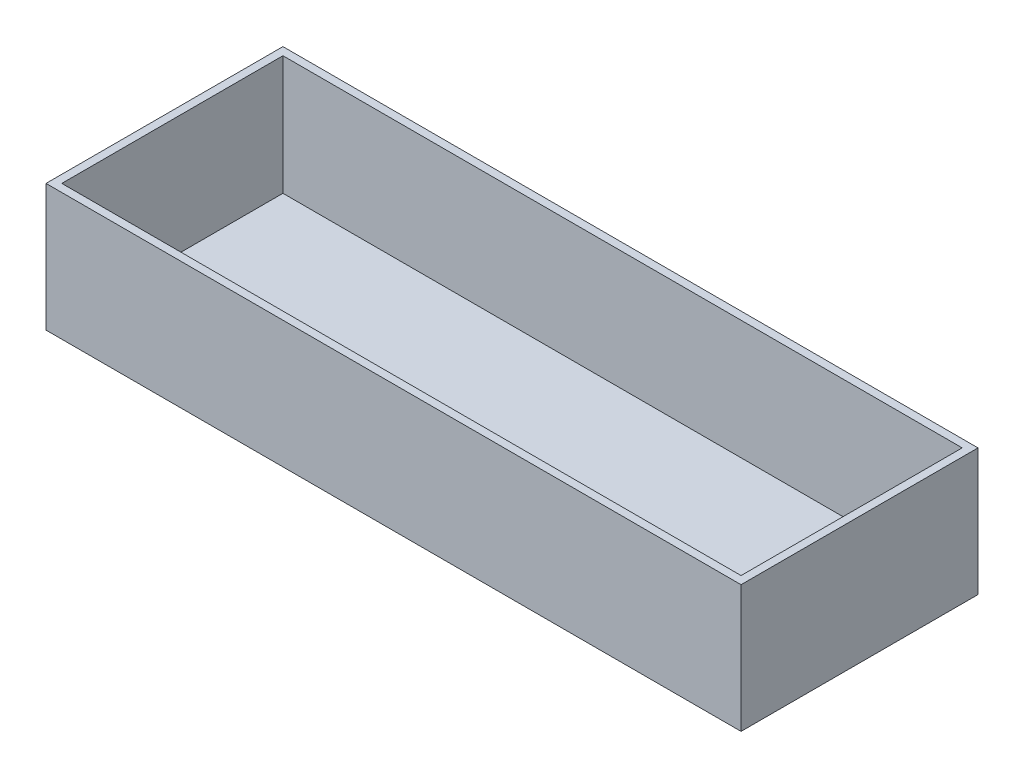
ISO-10303-21;
HEADER;
FILE_DESCRIPTION(('STEP AP214'),'2;1');
FILE_NAME('part.step','',(''),(''),'','','');
FILE_SCHEMA(('AUTOMOTIVE_DESIGN { 1 0 10303 214 1 1 1 1 }'));
ENDSEC;
DATA;
#1=APPLICATION_CONTEXT('core data for automotive mechanical design processes');
#2=APPLICATION_PROTOCOL_DEFINITION('international standard','automotive_design',2000,#1);
#3=PRODUCT_CONTEXT('',#1,'mechanical');
#4=PRODUCT('Part','Part','',(#3));
#5=PRODUCT_RELATED_PRODUCT_CATEGORY('part','',(#4));
#6=PRODUCT_DEFINITION_FORMATION('','',#4);
#7=PRODUCT_DEFINITION_CONTEXT('part definition',#1,'design');
#8=PRODUCT_DEFINITION('design','',#6,#7);
#9=PRODUCT_DEFINITION_SHAPE('','',#8);
#10=(LENGTH_UNIT() NAMED_UNIT(*) SI_UNIT(.MILLI.,.METRE.));
#11=(NAMED_UNIT(*) PLANE_ANGLE_UNIT() SI_UNIT($,.RADIAN.));
#12=(NAMED_UNIT(*) SI_UNIT($,.STERADIAN.) SOLID_ANGLE_UNIT());
#13=UNCERTAINTY_MEASURE_WITH_UNIT(LENGTH_MEASURE(1.E-05),#10,'distance_accuracy_value','');
#14=(GEOMETRIC_REPRESENTATION_CONTEXT(3) GLOBAL_UNCERTAINTY_ASSIGNED_CONTEXT((#13)) GLOBAL_UNIT_ASSIGNED_CONTEXT((#10,
#11,#12)) REPRESENTATION_CONTEXT('',''));
#15=CARTESIAN_POINT('',(0.,0.,0.));
#16=DIRECTION('',(0.,0.,1.));
#17=DIRECTION('',(1.,0.,0.));
#18=AXIS2_PLACEMENT_3D('',#15,#16,#17);
#19=CARTESIAN_POINT('',(139.7,3.175,47.625));
#20=DIRECTION('',(-1.,0.,0.));
#21=DIRECTION('',(0.,0.,1.));
#22=AXIS2_PLACEMENT_3D('',#19,#20,#21);
#23=PLANE('',#22);
#24=DIRECTION('',(0.,0.,-1.));
#25=VECTOR('',#24,1.);
#26=CARTESIAN_POINT('',(139.7,0.,47.625));
#27=LINE('',#26,#25);
#28=CARTESIAN_POINT('',(139.7,0.,47.625));
#29=VERTEX_POINT('',#28);
#30=CARTESIAN_POINT('',(139.7,0.,-47.625));
#31=VERTEX_POINT('',#30);
#32=EDGE_CURVE('E148',#29,#31,#27,.T.);
#33=ORIENTED_EDGE('',*,*,#32,.T.);
#34=DIRECTION('',(0.,-1.,0.));
#35=VECTOR('',#34,1.);
#36=CARTESIAN_POINT('',(139.7,3.175,-47.625));
#37=LINE('',#36,#35);
#38=CARTESIAN_POINT('',(139.7,51.0794,-47.625));
#39=VERTEX_POINT('',#38);
#40=EDGE_CURVE('E11',#39,#31,#37,.T.);
#41=ORIENTED_EDGE('',*,*,#40,.F.);
#42=DIRECTION('',(0.,0.,-1.));
#43=VECTOR('',#42,1.);
#44=CARTESIAN_POINT('',(139.7,51.0794,47.625));
#45=LINE('',#44,#43);
#46=CARTESIAN_POINT('',(139.7,51.0794,47.625));
#47=VERTEX_POINT('',#46);
#48=EDGE_CURVE('E139',#47,#39,#45,.T.);
#49=ORIENTED_EDGE('',*,*,#48,.F.);
#50=DIRECTION('',(0.,-1.,0.));
#51=VECTOR('',#50,1.);
#52=CARTESIAN_POINT('',(139.7,3.175,47.625));
#53=LINE('',#52,#51);
#54=EDGE_CURVE('E156',#47,#29,#53,.T.);
#55=ORIENTED_EDGE('',*,*,#54,.T.);
#56=EDGE_LOOP('',(#33,#41,#49,#55));
#57=FACE_BOUND('',#56,.T.);
#58=ADVANCED_FACE('F31',(#57),#23,.F.);
#59=CARTESIAN_POINT('',(-139.7,3.175,-47.625));
#60=DIRECTION('',(0.,0.,1.));
#61=DIRECTION('',(1.,0.,0.));
#62=AXIS2_PLACEMENT_3D('',#59,#60,#61);
#63=PLANE('',#62);
#64=DIRECTION('',(-1.,0.,0.));
#65=VECTOR('',#64,1.);
#66=CARTESIAN_POINT('',(-139.7,0.,-47.625));
#67=LINE('',#66,#65);
#68=CARTESIAN_POINT('',(-139.7,0.,-47.625));
#69=VERTEX_POINT('',#68);
#70=EDGE_CURVE('E151',#31,#69,#67,.T.);
#71=ORIENTED_EDGE('',*,*,#70,.T.);
#72=DIRECTION('',(0.,-1.,0.));
#73=VECTOR('',#72,1.);
#74=CARTESIAN_POINT('',(-139.7,3.175,-47.625));
#75=LINE('',#74,#73);
#76=CARTESIAN_POINT('',(-139.7,51.0794,-47.625));
#77=VERTEX_POINT('',#76);
#78=EDGE_CURVE('E38',#77,#69,#75,.T.);
#79=ORIENTED_EDGE('',*,*,#78,.F.);
#80=DIRECTION('',(-1.,0.,0.));
#81=VECTOR('',#80,1.);
#82=CARTESIAN_POINT('',(139.7,51.0794,-47.625));
#83=LINE('',#82,#81);
#84=EDGE_CURVE('E142',#39,#77,#83,.T.);
#85=ORIENTED_EDGE('',*,*,#84,.F.);
#86=ORIENTED_EDGE('',*,*,#40,.T.);
#87=EDGE_LOOP('',(#71,#79,#85,#86));
#88=FACE_BOUND('',#87,.T.);
#89=ADVANCED_FACE('F174',(#88),#63,.F.);
#90=CARTESIAN_POINT('',(-139.7,3.175,47.625));
#91=DIRECTION('',(1.,0.,0.));
#92=DIRECTION('',(0.,0.,-1.));
#93=AXIS2_PLACEMENT_3D('',#90,#91,#92);
#94=PLANE('',#93);
#95=DIRECTION('',(0.,0.,1.));
#96=VECTOR('',#95,1.);
#97=CARTESIAN_POINT('',(-139.7,0.,47.625));
#98=LINE('',#97,#96);
#99=CARTESIAN_POINT('',(-139.7,0.,47.625));
#100=VERTEX_POINT('',#99);
#101=EDGE_CURVE('E153',#69,#100,#98,.T.);
#102=ORIENTED_EDGE('',*,*,#101,.T.);
#103=DIRECTION('',(0.,-1.,0.));
#104=VECTOR('',#103,1.);
#105=CARTESIAN_POINT('',(-139.7,3.175,47.625));
#106=LINE('',#105,#104);
#107=CARTESIAN_POINT('',(-139.7,51.0794,47.625));
#108=VERTEX_POINT('',#107);
#109=EDGE_CURVE('E158',#108,#100,#106,.T.);
#110=ORIENTED_EDGE('',*,*,#109,.F.);
#111=DIRECTION('',(0.,0.,1.));
#112=VECTOR('',#111,1.);
#113=CARTESIAN_POINT('',(-139.7,51.0794,-47.625));
#114=LINE('',#113,#112);
#115=EDGE_CURVE('E145',#77,#108,#114,.T.);
#116=ORIENTED_EDGE('',*,*,#115,.F.);
#117=ORIENTED_EDGE('',*,*,#78,.T.);
#118=EDGE_LOOP('',(#102,#110,#116,#117));
#119=FACE_BOUND('',#118,.T.);
#120=ADVANCED_FACE('F163',(#119),#94,.F.);
#121=CARTESIAN_POINT('',(-139.7,3.175,47.625));
#122=DIRECTION('',(0.,0.,-1.));
#123=DIRECTION('',(-1.,0.,0.));
#124=AXIS2_PLACEMENT_3D('',#121,#122,#123);
#125=PLANE('',#124);
#126=DIRECTION('',(1.,0.,0.));
#127=VECTOR('',#126,1.);
#128=CARTESIAN_POINT('',(-139.7,0.,47.625));
#129=LINE('',#128,#127);
#130=EDGE_CURVE('E53',#100,#29,#129,.T.);
#131=ORIENTED_EDGE('',*,*,#130,.T.);
#132=ORIENTED_EDGE('',*,*,#54,.F.);
#133=DIRECTION('',(1.,0.,0.));
#134=VECTOR('',#133,1.);
#135=CARTESIAN_POINT('',(-139.7,51.0794,47.625));
#136=LINE('',#135,#134);
#137=EDGE_CURVE('E113',#108,#47,#136,.T.);
#138=ORIENTED_EDGE('',*,*,#137,.F.);
#139=ORIENTED_EDGE('',*,*,#109,.T.);
#140=EDGE_LOOP('',(#131,#132,#138,#139));
#141=FACE_BOUND('',#140,.T.);
#142=ADVANCED_FACE('F172',(#141),#125,.F.);
#143=CARTESIAN_POINT('',(139.7,0.,-47.625));
#144=DIRECTION('',(0.,-1.,0.));
#145=DIRECTION('',(0.,0.,-1.));
#146=AXIS2_PLACEMENT_3D('',#143,#144,#145);
#147=PLANE('',#146);
#148=ORIENTED_EDGE('',*,*,#32,.F.);
#149=ORIENTED_EDGE('',*,*,#130,.F.);
#150=ORIENTED_EDGE('',*,*,#101,.F.);
#151=ORIENTED_EDGE('',*,*,#70,.F.);
#152=EDGE_LOOP('',(#148,#149,#150,#151));
#153=FACE_BOUND('',#152,.T.);
#154=ADVANCED_FACE('F168',(#153),#147,.T.);
#155=CARTESIAN_POINT('',(139.7,51.0794,47.625));
#156=DIRECTION('',(0.,1.,0.));
#157=DIRECTION('',(0.,0.,1.));
#158=AXIS2_PLACEMENT_3D('',#155,#156,#157);
#159=PLANE('',#158);
#160=ORIENTED_EDGE('',*,*,#137,.T.);
#161=ORIENTED_EDGE('',*,*,#48,.T.);
#162=ORIENTED_EDGE('',*,*,#84,.T.);
#163=ORIENTED_EDGE('',*,*,#115,.T.);
#164=EDGE_LOOP('',(#160,#161,#162,#163));
#165=FACE_BOUND('',#164,.T.);
#166=DIRECTION('',(0.,0.,-1.));
#167=VECTOR('',#166,1.);
#168=CARTESIAN_POINT('',(136.525,51.0794,44.45));
#169=LINE('',#168,#167);
#170=CARTESIAN_POINT('',(136.525,51.0794,44.45));
#171=VERTEX_POINT('',#170);
#172=CARTESIAN_POINT('',(136.525,51.0794,-44.45));
#173=VERTEX_POINT('',#172);
#174=EDGE_CURVE('E105',#171,#173,#169,.T.);
#175=ORIENTED_EDGE('',*,*,#174,.F.);
#176=DIRECTION('',(1.,0.,0.));
#177=VECTOR('',#176,1.);
#178=CARTESIAN_POINT('',(-136.525,51.0794,44.45));
#179=LINE('',#178,#177);
#180=CARTESIAN_POINT('',(-136.525,51.0794,44.45));
#181=VERTEX_POINT('',#180);
#182=EDGE_CURVE('E97',#181,#171,#179,.T.);
#183=ORIENTED_EDGE('',*,*,#182,.F.);
#184=DIRECTION('',(0.,0.,1.));
#185=VECTOR('',#184,1.);
#186=CARTESIAN_POINT('',(-136.525,51.0794,-44.45));
#187=LINE('',#186,#185);
#188=CARTESIAN_POINT('',(-136.525,51.0794,-44.45));
#189=VERTEX_POINT('',#188);
#190=EDGE_CURVE('E121',#189,#181,#187,.T.);
#191=ORIENTED_EDGE('',*,*,#190,.F.);
#192=DIRECTION('',(-1.,0.,0.));
#193=VECTOR('',#192,1.);
#194=CARTESIAN_POINT('',(136.525,51.0794,-44.45));
#195=LINE('',#194,#193);
#196=EDGE_CURVE('E119',#173,#189,#195,.T.);
#197=ORIENTED_EDGE('',*,*,#196,.F.);
#198=EDGE_LOOP('',(#175,#183,#191,#197));
#199=FACE_BOUND('',#198,.T.);
#200=ADVANCED_FACE('F117',(#165,#199),#159,.T.);
#201=CARTESIAN_POINT('',(-136.525,51.0794,44.45));
#202=DIRECTION('',(0.,0.,-1.));
#203=DIRECTION('',(-1.,0.,0.));
#204=AXIS2_PLACEMENT_3D('',#201,#202,#203);
#205=PLANE('',#204);
#206=DIRECTION('',(1.,0.,0.));
#207=VECTOR('',#206,1.);
#208=CARTESIAN_POINT('',(-136.525,3.175,44.45));
#209=LINE('',#208,#207);
#210=CARTESIAN_POINT('',(-136.525,3.175,44.45));
#211=VERTEX_POINT('',#210);
#212=CARTESIAN_POINT('',(136.525,3.175,44.45));
#213=VERTEX_POINT('',#212);
#214=EDGE_CURVE('E125',#211,#213,#209,.T.);
#215=ORIENTED_EDGE('',*,*,#214,.F.);
#216=DIRECTION('',(0.,-1.,0.));
#217=VECTOR('',#216,1.);
#218=CARTESIAN_POINT('',(-136.525,51.0794,44.45));
#219=LINE('',#218,#217);
#220=EDGE_CURVE('E45',#181,#211,#219,.T.);
#221=ORIENTED_EDGE('',*,*,#220,.F.);
#222=ORIENTED_EDGE('',*,*,#182,.T.);
#223=DIRECTION('',(0.,-1.,0.));
#224=VECTOR('',#223,1.);
#225=CARTESIAN_POINT('',(136.525,51.0794,44.45));
#226=LINE('',#225,#224);
#227=EDGE_CURVE('E100',#171,#213,#226,.T.);
#228=ORIENTED_EDGE('',*,*,#227,.T.);
#229=EDGE_LOOP('',(#215,#221,#222,#228));
#230=FACE_BOUND('',#229,.T.);
#231=ADVANCED_FACE('F99',(#230),#205,.T.);
#232=CARTESIAN_POINT('',(136.525,51.0794,44.45));
#233=DIRECTION('',(-1.,0.,0.));
#234=DIRECTION('',(0.,0.,1.));
#235=AXIS2_PLACEMENT_3D('',#232,#233,#234);
#236=PLANE('',#235);
#237=DIRECTION('',(0.,0.,-1.));
#238=VECTOR('',#237,1.);
#239=CARTESIAN_POINT('',(136.525,3.175,44.45));
#240=LINE('',#239,#238);
#241=CARTESIAN_POINT('',(136.525,3.175,-44.45));
#242=VERTEX_POINT('',#241);
#243=EDGE_CURVE('E112',#213,#242,#240,.T.);
#244=ORIENTED_EDGE('',*,*,#243,.F.);
#245=ORIENTED_EDGE('',*,*,#227,.F.);
#246=ORIENTED_EDGE('',*,*,#174,.T.);
#247=DIRECTION('',(0.,-1.,0.));
#248=VECTOR('',#247,1.);
#249=CARTESIAN_POINT('',(136.525,51.0794,-44.45));
#250=LINE('',#249,#248);
#251=EDGE_CURVE('E114',#173,#242,#250,.T.);
#252=ORIENTED_EDGE('',*,*,#251,.T.);
#253=EDGE_LOOP('',(#244,#245,#246,#252));
#254=FACE_BOUND('',#253,.T.);
#255=ADVANCED_FACE('F109',(#254),#236,.T.);
#256=CARTESIAN_POINT('',(136.525,51.0794,-44.45));
#257=DIRECTION('',(0.,0.,1.));
#258=DIRECTION('',(1.,0.,0.));
#259=AXIS2_PLACEMENT_3D('',#256,#257,#258);
#260=PLANE('',#259);
#261=DIRECTION('',(-1.,0.,0.));
#262=VECTOR('',#261,1.);
#263=CARTESIAN_POINT('',(136.525,3.175,-44.45));
#264=LINE('',#263,#262);
#265=CARTESIAN_POINT('',(-136.525,3.175,-44.45));
#266=VERTEX_POINT('',#265);
#267=EDGE_CURVE('E128',#242,#266,#264,.T.);
#268=ORIENTED_EDGE('',*,*,#267,.F.);
#269=ORIENTED_EDGE('',*,*,#251,.F.);
#270=ORIENTED_EDGE('',*,*,#196,.T.);
#271=DIRECTION('',(0.,-1.,0.));
#272=VECTOR('',#271,1.);
#273=CARTESIAN_POINT('',(-136.525,51.0794,-44.45));
#274=LINE('',#273,#272);
#275=EDGE_CURVE('E134',#189,#266,#274,.T.);
#276=ORIENTED_EDGE('',*,*,#275,.T.);
#277=EDGE_LOOP('',(#268,#269,#270,#276));
#278=FACE_BOUND('',#277,.T.);
#279=ADVANCED_FACE('F197',(#278),#260,.T.);
#280=CARTESIAN_POINT('',(-136.525,51.0794,-44.45));
#281=DIRECTION('',(1.,0.,0.));
#282=DIRECTION('',(0.,0.,-1.));
#283=AXIS2_PLACEMENT_3D('',#280,#281,#282);
#284=PLANE('',#283);
#285=DIRECTION('',(0.,0.,1.));
#286=VECTOR('',#285,1.);
#287=CARTESIAN_POINT('',(-136.525,3.175,-44.45));
#288=LINE('',#287,#286);
#289=EDGE_CURVE('E106',#266,#211,#288,.T.);
#290=ORIENTED_EDGE('',*,*,#289,.F.);
#291=ORIENTED_EDGE('',*,*,#275,.F.);
#292=ORIENTED_EDGE('',*,*,#190,.T.);
#293=ORIENTED_EDGE('',*,*,#220,.T.);
#294=EDGE_LOOP('',(#290,#291,#292,#293));
#295=FACE_BOUND('',#294,.T.);
#296=ADVANCED_FACE('F189',(#295),#284,.T.);
#297=CARTESIAN_POINT('',(139.7,3.175,-47.625));
#298=DIRECTION('',(0.,-1.,0.));
#299=DIRECTION('',(0.,0.,-1.));
#300=AXIS2_PLACEMENT_3D('',#297,#298,#299);
#301=PLANE('',#300);
#302=ORIENTED_EDGE('',*,*,#289,.T.);
#303=ORIENTED_EDGE('',*,*,#214,.T.);
#304=ORIENTED_EDGE('',*,*,#243,.T.);
#305=ORIENTED_EDGE('',*,*,#267,.T.);
#306=EDGE_LOOP('',(#302,#303,#304,#305));
#307=FACE_BOUND('',#306,.T.);
#308=ADVANCED_FACE('F186',(#307),#301,.F.);
#309=CLOSED_SHELL('',(#58,#89,#120,#142,#154,#200,#231,#255,#279,#296,#308));
#310=MANIFOLD_SOLID_BREP('B2',#309);
#311=ADVANCED_BREP_SHAPE_REPRESENTATION('',(#18,#310),#14);
#312=SHAPE_DEFINITION_REPRESENTATION(#9,#311);
ENDSEC;
END-ISO-10303-21;
